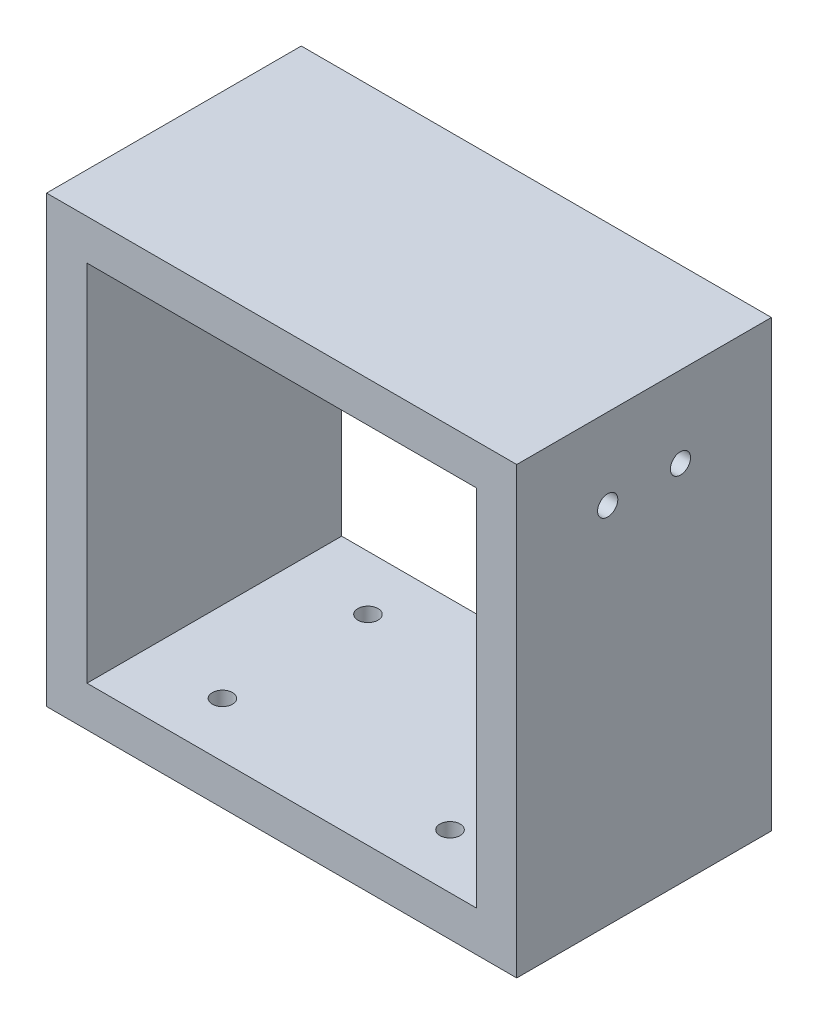
ISO-10303-21;
HEADER;
FILE_DESCRIPTION(('STEP AP214'),'2;1');
FILE_NAME('part.step','',(''),(''),'','','');
FILE_SCHEMA(('AUTOMOTIVE_DESIGN { 1 0 10303 214 1 1 1 1 }'));
ENDSEC;
DATA;
#1=APPLICATION_CONTEXT('core data for automotive mechanical design processes');
#2=APPLICATION_PROTOCOL_DEFINITION('international standard','automotive_design',2000,#1);
#3=PRODUCT_CONTEXT('',#1,'mechanical');
#4=PRODUCT('Part','Part','',(#3));
#5=PRODUCT_RELATED_PRODUCT_CATEGORY('part','',(#4));
#6=PRODUCT_DEFINITION_FORMATION('','',#4);
#7=PRODUCT_DEFINITION_CONTEXT('part definition',#1,'design');
#8=PRODUCT_DEFINITION('design','',#6,#7);
#9=PRODUCT_DEFINITION_SHAPE('','',#8);
#10=(LENGTH_UNIT() NAMED_UNIT(*) SI_UNIT(.MILLI.,.METRE.));
#11=(NAMED_UNIT(*) PLANE_ANGLE_UNIT() SI_UNIT($,.RADIAN.));
#12=(NAMED_UNIT(*) SI_UNIT($,.STERADIAN.) SOLID_ANGLE_UNIT());
#13=UNCERTAINTY_MEASURE_WITH_UNIT(LENGTH_MEASURE(1.E-05),#10,'distance_accuracy_value','');
#14=(GEOMETRIC_REPRESENTATION_CONTEXT(3) GLOBAL_UNCERTAINTY_ASSIGNED_CONTEXT((#13)) GLOBAL_UNIT_ASSIGNED_CONTEXT((#10,
#11,#12)) REPRESENTATION_CONTEXT('',''));
#15=CARTESIAN_POINT('',(0.,0.,0.));
#16=DIRECTION('',(0.,0.,1.));
#17=DIRECTION('',(1.,0.,0.));
#18=AXIS2_PLACEMENT_3D('',#15,#16,#17);
#19=CARTESIAN_POINT('',(0.,-55.,0.));
#20=DIRECTION('',(-1.,0.,0.));
#21=DIRECTION('',(0.,0.,1.));
#22=AXIS2_PLACEMENT_3D('',#19,#20,#21);
#23=PLANE('',#22);
#24=CARTESIAN_POINT('',(0.,-9.99999999999994,-11.25));
#25=DIRECTION('',(-1.,0.,0.));
#26=DIRECTION('',(0.,0.,1.));
#27=AXIS2_PLACEMENT_3D('',#24,#25,#26);
#28=CIRCLE('',#27,1.25);
#29=CARTESIAN_POINT('',(0.,-9.99999999999994,-10.));
#30=VERTEX_POINT('',#29);
#31=EDGE_CURVE('E206',#30,#30,#28,.T.);
#32=ORIENTED_EDGE('',*,*,#31,.F.);
#33=EDGE_LOOP('',(#32));
#34=FACE_BOUND('',#33,.T.);
#35=CARTESIAN_POINT('',(0.,-9.99999999999994,-20.25));
#36=DIRECTION('',(-1.,0.,0.));
#37=DIRECTION('',(0.,0.,1.));
#38=AXIS2_PLACEMENT_3D('',#35,#36,#37);
#39=CIRCLE('',#38,1.25);
#40=CARTESIAN_POINT('',(0.,-9.99999999999994,-19.));
#41=VERTEX_POINT('',#40);
#42=EDGE_CURVE('E211',#41,#41,#39,.T.);
#43=ORIENTED_EDGE('',*,*,#42,.F.);
#44=EDGE_LOOP('',(#43));
#45=FACE_BOUND('',#44,.T.);
#46=DIRECTION('',(0.,0.,1.));
#47=VECTOR('',#46,1.);
#48=CARTESIAN_POINT('',(0.,0.,0.));
#49=LINE('',#48,#47);
#50=CARTESIAN_POINT('',(0.,0.,-31.5));
#51=VERTEX_POINT('',#50);
#52=CARTESIAN_POINT('',(0.,0.,0.));
#53=VERTEX_POINT('',#52);
#54=EDGE_CURVE('E140',#51,#53,#49,.T.);
#55=ORIENTED_EDGE('',*,*,#54,.F.);
#56=DIRECTION('',(0.,1.,0.));
#57=VECTOR('',#56,1.);
#58=CARTESIAN_POINT('',(0.,-55.,-31.5));
#59=LINE('',#58,#57);
#60=CARTESIAN_POINT('',(0.,-55.,-31.5));
#61=VERTEX_POINT('',#60);
#62=EDGE_CURVE('E11',#61,#51,#59,.T.);
#63=ORIENTED_EDGE('',*,*,#62,.F.);
#64=DIRECTION('',(0.,0.,1.));
#65=VECTOR('',#64,1.);
#66=CARTESIAN_POINT('',(0.,-55.,0.));
#67=LINE('',#66,#65);
#68=CARTESIAN_POINT('',(0.,-55.,0.));
#69=VERTEX_POINT('',#68);
#70=EDGE_CURVE('E141',#61,#69,#67,.T.);
#71=ORIENTED_EDGE('',*,*,#70,.T.);
#72=DIRECTION('',(0.,1.,0.));
#73=VECTOR('',#72,1.);
#74=CARTESIAN_POINT('',(0.,-55.,0.));
#75=LINE('',#74,#73);
#76=EDGE_CURVE('E154',#69,#53,#75,.T.);
#77=ORIENTED_EDGE('',*,*,#76,.T.);
#78=EDGE_LOOP('',(#55,#63,#71,#77));
#79=FACE_BOUND('',#78,.T.);
#80=ADVANCED_FACE('F38',(#34,#45,#79),#23,.T.);
#81=CARTESIAN_POINT('',(0.,-55.,-31.5));
#82=DIRECTION('',(0.,0.,-1.));
#83=DIRECTION('',(-1.,0.,0.));
#84=AXIS2_PLACEMENT_3D('',#81,#82,#83);
#85=PLANE('',#84);
#86=DIRECTION('',(-1.,0.,0.));
#87=VECTOR('',#86,1.);
#88=CARTESIAN_POINT('',(4.99999999999999,-5.00000000000001,-31.5));
#89=LINE('',#88,#87);
#90=CARTESIAN_POINT('',(53.15,-5.,-31.5));
#91=VERTEX_POINT('',#90);
#92=CARTESIAN_POINT('',(4.99999999999999,-5.00000000000001,-31.5));
#93=VERTEX_POINT('',#92);
#94=EDGE_CURVE('E117',#91,#93,#89,.T.);
#95=ORIENTED_EDGE('',*,*,#94,.T.);
#96=DIRECTION('',(0.,-1.,0.));
#97=VECTOR('',#96,1.);
#98=CARTESIAN_POINT('',(5.,-50.,-31.5));
#99=LINE('',#98,#97);
#100=CARTESIAN_POINT('',(5.,-50.,-31.5));
#101=VERTEX_POINT('',#100);
#102=EDGE_CURVE('E104',#93,#101,#99,.T.);
#103=ORIENTED_EDGE('',*,*,#102,.T.);
#104=DIRECTION('',(1.,0.,0.));
#105=VECTOR('',#104,1.);
#106=CARTESIAN_POINT('',(5.,-50.,-31.5));
#107=LINE('',#106,#105);
#108=CARTESIAN_POINT('',(53.15,-50.,-31.5));
#109=VERTEX_POINT('',#108);
#110=EDGE_CURVE('E135',#101,#109,#107,.T.);
#111=ORIENTED_EDGE('',*,*,#110,.T.);
#112=DIRECTION('',(0.,1.,0.));
#113=VECTOR('',#112,1.);
#114=CARTESIAN_POINT('',(53.15,-50.,-31.5));
#115=LINE('',#114,#113);
#116=EDGE_CURVE('E125',#109,#91,#115,.T.);
#117=ORIENTED_EDGE('',*,*,#116,.T.);
#118=EDGE_LOOP('',(#95,#103,#111,#117));
#119=FACE_BOUND('',#118,.T.);
#120=DIRECTION('',(-1.,0.,0.));
#121=VECTOR('',#120,1.);
#122=CARTESIAN_POINT('',(0.,0.,-31.5));
#123=LINE('',#122,#121);
#124=CARTESIAN_POINT('',(58.15,0.,-31.5));
#125=VERTEX_POINT('',#124);
#126=EDGE_CURVE('E145',#125,#51,#123,.T.);
#127=ORIENTED_EDGE('',*,*,#126,.F.);
#128=DIRECTION('',(0.,1.,0.));
#129=VECTOR('',#128,1.);
#130=CARTESIAN_POINT('',(58.15,-55.,-31.5));
#131=LINE('',#130,#129);
#132=CARTESIAN_POINT('',(58.15,-55.,-31.5));
#133=VERTEX_POINT('',#132);
#134=EDGE_CURVE('E46',#133,#125,#131,.T.);
#135=ORIENTED_EDGE('',*,*,#134,.F.);
#136=DIRECTION('',(-1.,0.,0.));
#137=VECTOR('',#136,1.);
#138=CARTESIAN_POINT('',(0.,-55.,-31.5));
#139=LINE('',#138,#137);
#140=EDGE_CURVE('E151',#133,#61,#139,.T.);
#141=ORIENTED_EDGE('',*,*,#140,.T.);
#142=ORIENTED_EDGE('',*,*,#62,.T.);
#143=EDGE_LOOP('',(#127,#135,#141,#142));
#144=FACE_BOUND('',#143,.T.);
#145=ADVANCED_FACE('F123',(#119,#144),#85,.T.);
#146=CARTESIAN_POINT('',(58.15,-55.,0.));
#147=DIRECTION('',(1.,0.,0.));
#148=DIRECTION('',(0.,0.,-1.));
#149=AXIS2_PLACEMENT_3D('',#146,#147,#148);
#150=PLANE('',#149);
#151=CARTESIAN_POINT('',(58.15,-9.99999999999996,-20.25));
#152=DIRECTION('',(1.,0.,0.));
#153=DIRECTION('',(0.,0.,-1.));
#154=AXIS2_PLACEMENT_3D('',#151,#152,#153);
#155=CIRCLE('',#154,1.25);
#156=CARTESIAN_POINT('',(58.15,-9.99999999999996,-21.5));
#157=VERTEX_POINT('',#156);
#158=EDGE_CURVE('E196',#157,#157,#155,.T.);
#159=ORIENTED_EDGE('',*,*,#158,.F.);
#160=EDGE_LOOP('',(#159));
#161=FACE_BOUND('',#160,.T.);
#162=CARTESIAN_POINT('',(58.15,-9.99999999999996,-11.25));
#163=DIRECTION('',(1.,0.,0.));
#164=DIRECTION('',(0.,0.,-1.));
#165=AXIS2_PLACEMENT_3D('',#162,#163,#164);
#166=CIRCLE('',#165,1.25);
#167=CARTESIAN_POINT('',(58.15,-9.99999999999996,-12.5));
#168=VERTEX_POINT('',#167);
#169=EDGE_CURVE('E199',#168,#168,#166,.T.);
#170=ORIENTED_EDGE('',*,*,#169,.F.);
#171=EDGE_LOOP('',(#170));
#172=FACE_BOUND('',#171,.T.);
#173=DIRECTION('',(0.,0.,-1.));
#174=VECTOR('',#173,1.);
#175=CARTESIAN_POINT('',(58.15,0.,0.));
#176=LINE('',#175,#174);
#177=CARTESIAN_POINT('',(58.15,0.,0.));
#178=VERTEX_POINT('',#177);
#179=EDGE_CURVE('E160',#178,#125,#176,.T.);
#180=ORIENTED_EDGE('',*,*,#179,.F.);
#181=DIRECTION('',(0.,1.,0.));
#182=VECTOR('',#181,1.);
#183=CARTESIAN_POINT('',(58.15,-55.,0.));
#184=LINE('',#183,#182);
#185=CARTESIAN_POINT('',(58.15,-55.,0.));
#186=VERTEX_POINT('',#185);
#187=EDGE_CURVE('E166',#186,#178,#184,.T.);
#188=ORIENTED_EDGE('',*,*,#187,.F.);
#189=DIRECTION('',(0.,0.,-1.));
#190=VECTOR('',#189,1.);
#191=CARTESIAN_POINT('',(58.15,-55.,0.));
#192=LINE('',#191,#190);
#193=EDGE_CURVE('E148',#186,#133,#192,.T.);
#194=ORIENTED_EDGE('',*,*,#193,.T.);
#195=ORIENTED_EDGE('',*,*,#134,.T.);
#196=EDGE_LOOP('',(#180,#188,#194,#195));
#197=FACE_BOUND('',#196,.T.);
#198=ADVANCED_FACE('F249',(#161,#172,#197),#150,.T.);
#199=CARTESIAN_POINT('',(0.,-55.,0.));
#200=DIRECTION('',(0.,0.,1.));
#201=DIRECTION('',(1.,0.,0.));
#202=AXIS2_PLACEMENT_3D('',#199,#200,#201);
#203=PLANE('',#202);
#204=DIRECTION('',(-1.,0.,0.));
#205=VECTOR('',#204,1.);
#206=CARTESIAN_POINT('',(4.99999999999999,-5.00000000000001,0.));
#207=LINE('',#206,#205);
#208=CARTESIAN_POINT('',(53.15,-5.,0.));
#209=VERTEX_POINT('',#208);
#210=CARTESIAN_POINT('',(4.99999999999999,-5.00000000000001,0.));
#211=VERTEX_POINT('',#210);
#212=EDGE_CURVE('E120',#209,#211,#207,.T.);
#213=ORIENTED_EDGE('',*,*,#212,.F.);
#214=DIRECTION('',(0.,1.,0.));
#215=VECTOR('',#214,1.);
#216=CARTESIAN_POINT('',(53.15,-50.,0.));
#217=LINE('',#216,#215);
#218=CARTESIAN_POINT('',(53.15,-50.,0.));
#219=VERTEX_POINT('',#218);
#220=EDGE_CURVE('E131',#219,#209,#217,.T.);
#221=ORIENTED_EDGE('',*,*,#220,.F.);
#222=DIRECTION('',(1.,0.,0.));
#223=VECTOR('',#222,1.);
#224=CARTESIAN_POINT('',(5.,-50.,0.));
#225=LINE('',#224,#223);
#226=CARTESIAN_POINT('',(5.,-50.,0.));
#227=VERTEX_POINT('',#226);
#228=EDGE_CURVE('E62',#227,#219,#225,.T.);
#229=ORIENTED_EDGE('',*,*,#228,.F.);
#230=DIRECTION('',(0.,-1.,0.));
#231=VECTOR('',#230,1.);
#232=CARTESIAN_POINT('',(5.,-50.,0.));
#233=LINE('',#232,#231);
#234=EDGE_CURVE('E127',#211,#227,#233,.T.);
#235=ORIENTED_EDGE('',*,*,#234,.F.);
#236=EDGE_LOOP('',(#213,#221,#229,#235));
#237=FACE_BOUND('',#236,.T.);
#238=DIRECTION('',(1.,0.,0.));
#239=VECTOR('',#238,1.);
#240=CARTESIAN_POINT('',(0.,0.,0.));
#241=LINE('',#240,#239);
#242=EDGE_CURVE('E157',#53,#178,#241,.T.);
#243=ORIENTED_EDGE('',*,*,#242,.F.);
#244=ORIENTED_EDGE('',*,*,#76,.F.);
#245=DIRECTION('',(1.,0.,0.));
#246=VECTOR('',#245,1.);
#247=CARTESIAN_POINT('',(0.,-55.,0.));
#248=LINE('',#247,#246);
#249=EDGE_CURVE('E144',#69,#186,#248,.T.);
#250=ORIENTED_EDGE('',*,*,#249,.T.);
#251=ORIENTED_EDGE('',*,*,#187,.T.);
#252=EDGE_LOOP('',(#243,#244,#250,#251));
#253=FACE_BOUND('',#252,.T.);
#254=ADVANCED_FACE('F268',(#237,#253),#203,.T.);
#255=CARTESIAN_POINT('',(0.,-55.,0.));
#256=DIRECTION('',(0.,-1.,0.));
#257=DIRECTION('',(0.,0.,-1.));
#258=AXIS2_PLACEMENT_3D('',#255,#256,#257);
#259=PLANE('',#258);
#260=CARTESIAN_POINT('',(15.,-55.,-24.750000000038));
#261=DIRECTION('',(0.,-1.,0.));
#262=DIRECTION('',(0.,0.,-1.));
#263=AXIS2_PLACEMENT_3D('',#260,#261,#262);
#264=CIRCLE('',#263,1.25);
#265=CARTESIAN_POINT('',(15.,-55.,-26.000000000038));
#266=VERTEX_POINT('',#265);
#267=EDGE_CURVE('E187',#266,#266,#264,.T.);
#268=ORIENTED_EDGE('',*,*,#267,.F.);
#269=EDGE_LOOP('',(#268));
#270=FACE_BOUND('',#269,.T.);
#271=CARTESIAN_POINT('',(43.1499999999999,-55.,-6.74999999997087));
#272=DIRECTION('',(0.,-1.,0.));
#273=DIRECTION('',(0.,0.,-1.));
#274=AXIS2_PLACEMENT_3D('',#271,#272,#273);
#275=CIRCLE('',#274,1.25);
#276=CARTESIAN_POINT('',(43.1499999999999,-55.,-7.99999999997087));
#277=VERTEX_POINT('',#276);
#278=EDGE_CURVE('E188',#277,#277,#275,.T.);
#279=ORIENTED_EDGE('',*,*,#278,.F.);
#280=EDGE_LOOP('',(#279));
#281=FACE_BOUND('',#280,.T.);
#282=CARTESIAN_POINT('',(43.1499999999999,-55.,-24.7499999999709));
#283=DIRECTION('',(0.,-1.,0.));
#284=DIRECTION('',(0.,0.,-1.));
#285=AXIS2_PLACEMENT_3D('',#282,#283,#284);
#286=CIRCLE('',#285,1.25);
#287=CARTESIAN_POINT('',(43.1499999999999,-55.,-25.9999999999709));
#288=VERTEX_POINT('',#287);
#289=EDGE_CURVE('E191',#288,#288,#286,.T.);
#290=ORIENTED_EDGE('',*,*,#289,.F.);
#291=EDGE_LOOP('',(#290));
#292=FACE_BOUND('',#291,.T.);
#293=CARTESIAN_POINT('',(15.,-55.,-6.75000000003798));
#294=DIRECTION('',(0.,-1.,0.));
#295=DIRECTION('',(0.,0.,-1.));
#296=AXIS2_PLACEMENT_3D('',#293,#294,#295);
#297=CIRCLE('',#296,1.25);
#298=CARTESIAN_POINT('',(15.,-55.,-8.00000000003798));
#299=VERTEX_POINT('',#298);
#300=EDGE_CURVE('E173',#299,#299,#297,.T.);
#301=ORIENTED_EDGE('',*,*,#300,.F.);
#302=EDGE_LOOP('',(#301));
#303=FACE_BOUND('',#302,.T.);
#304=ORIENTED_EDGE('',*,*,#70,.F.);
#305=ORIENTED_EDGE('',*,*,#140,.F.);
#306=ORIENTED_EDGE('',*,*,#193,.F.);
#307=ORIENTED_EDGE('',*,*,#249,.F.);
#308=EDGE_LOOP('',(#304,#305,#306,#307));
#309=FACE_BOUND('',#308,.T.);
#310=ADVANCED_FACE('F265',(#270,#281,#292,#303,#309),#259,.T.);
#311=CARTESIAN_POINT('',(0.,0.,0.));
#312=DIRECTION('',(0.,-1.,0.));
#313=DIRECTION('',(0.,0.,-1.));
#314=AXIS2_PLACEMENT_3D('',#311,#312,#313);
#315=PLANE('',#314);
#316=ORIENTED_EDGE('',*,*,#54,.T.);
#317=ORIENTED_EDGE('',*,*,#242,.T.);
#318=ORIENTED_EDGE('',*,*,#179,.T.);
#319=ORIENTED_EDGE('',*,*,#126,.T.);
#320=EDGE_LOOP('',(#316,#317,#318,#319));
#321=FACE_BOUND('',#320,.T.);
#322=ADVANCED_FACE('F260',(#321),#315,.F.);
#323=CARTESIAN_POINT('',(4.99999999999999,-5.00000000000001,-97.4046470288704));
#324=DIRECTION('',(0.,1.,0.));
#325=DIRECTION('',(-1.,0.,0.));
#326=AXIS2_PLACEMENT_3D('',#323,#324,#325);
#327=PLANE('',#326);
#328=DIRECTION('',(0.,0.,1.));
#329=VECTOR('',#328,1.);
#330=CARTESIAN_POINT('',(53.15,-5.,-97.4046470288704));
#331=LINE('',#330,#329);
#332=EDGE_CURVE('E54',#91,#209,#331,.T.);
#333=ORIENTED_EDGE('',*,*,#332,.T.);
#334=ORIENTED_EDGE('',*,*,#212,.T.);
#335=DIRECTION('',(0.,0.,1.));
#336=VECTOR('',#335,1.);
#337=CARTESIAN_POINT('',(4.99999999999999,-5.00000000000001,-97.4046470288704));
#338=LINE('',#337,#336);
#339=EDGE_CURVE('E108',#93,#211,#338,.T.);
#340=ORIENTED_EDGE('',*,*,#339,.F.);
#341=ORIENTED_EDGE('',*,*,#94,.F.);
#342=EDGE_LOOP('',(#333,#334,#340,#341));
#343=FACE_BOUND('',#342,.T.);
#344=ADVANCED_FACE('F116',(#343),#327,.F.);
#345=CARTESIAN_POINT('',(5.,-50.,-97.4046470288704));
#346=DIRECTION('',(-1.,0.,0.));
#347=DIRECTION('',(0.,-1.,0.));
#348=AXIS2_PLACEMENT_3D('',#345,#346,#347);
#349=PLANE('',#348);
#350=CARTESIAN_POINT('',(4.99999999999999,-9.99999999999994,-11.25));
#351=DIRECTION('',(1.,0.,0.));
#352=DIRECTION('',(0.,1.,0.));
#353=AXIS2_PLACEMENT_3D('',#350,#351,#352);
#354=CIRCLE('',#353,1.25);
#355=CARTESIAN_POINT('',(4.99999999999999,-8.74999999999994,-11.25));
#356=VERTEX_POINT('',#355);
#357=EDGE_CURVE('E214',#356,#356,#354,.T.);
#358=ORIENTED_EDGE('',*,*,#357,.F.);
#359=EDGE_LOOP('',(#358));
#360=FACE_BOUND('',#359,.T.);
#361=CARTESIAN_POINT('',(4.99999999999999,-9.99999999999994,-20.25));
#362=DIRECTION('',(1.,0.,0.));
#363=DIRECTION('',(0.,1.,0.));
#364=AXIS2_PLACEMENT_3D('',#361,#362,#363);
#365=CIRCLE('',#364,1.25);
#366=CARTESIAN_POINT('',(4.99999999999999,-8.74999999999994,-20.25));
#367=VERTEX_POINT('',#366);
#368=EDGE_CURVE('E215',#367,#367,#365,.T.);
#369=ORIENTED_EDGE('',*,*,#368,.F.);
#370=EDGE_LOOP('',(#369));
#371=FACE_BOUND('',#370,.T.);
#372=ORIENTED_EDGE('',*,*,#339,.T.);
#373=ORIENTED_EDGE('',*,*,#234,.T.);
#374=DIRECTION('',(0.,0.,1.));
#375=VECTOR('',#374,1.);
#376=CARTESIAN_POINT('',(5.,-50.,-97.4046470288704));
#377=LINE('',#376,#375);
#378=EDGE_CURVE('E110',#101,#227,#377,.T.);
#379=ORIENTED_EDGE('',*,*,#378,.F.);
#380=ORIENTED_EDGE('',*,*,#102,.F.);
#381=EDGE_LOOP('',(#372,#373,#379,#380));
#382=FACE_BOUND('',#381,.T.);
#383=ADVANCED_FACE('F106',(#360,#371,#382),#349,.F.);
#384=CARTESIAN_POINT('',(5.,-50.,-97.4046470288704));
#385=DIRECTION('',(0.,-1.,0.));
#386=DIRECTION('',(1.,0.,0.));
#387=AXIS2_PLACEMENT_3D('',#384,#385,#386);
#388=PLANE('',#387);
#389=CARTESIAN_POINT('',(15.,-50.,-24.750000000038));
#390=DIRECTION('',(0.,-1.,0.));
#391=DIRECTION('',(1.,0.,0.));
#392=AXIS2_PLACEMENT_3D('',#389,#390,#391);
#393=CIRCLE('',#392,1.25);
#394=CARTESIAN_POINT('',(16.25,-50.,-24.750000000038));
#395=VERTEX_POINT('',#394);
#396=EDGE_CURVE('E41',#395,#395,#393,.T.);
#397=ORIENTED_EDGE('',*,*,#396,.T.);
#398=EDGE_LOOP('',(#397));
#399=FACE_BOUND('',#398,.T.);
#400=CARTESIAN_POINT('',(43.1499999999999,-50.,-6.74999999997087));
#401=DIRECTION('',(0.,-1.,0.));
#402=DIRECTION('',(1.,0.,0.));
#403=AXIS2_PLACEMENT_3D('',#400,#401,#402);
#404=CIRCLE('',#403,1.25);
#405=CARTESIAN_POINT('',(44.4,-50.,-6.74999999997087));
#406=VERTEX_POINT('',#405);
#407=EDGE_CURVE('E175',#406,#406,#404,.T.);
#408=ORIENTED_EDGE('',*,*,#407,.T.);
#409=EDGE_LOOP('',(#408));
#410=FACE_BOUND('',#409,.T.);
#411=CARTESIAN_POINT('',(43.1499999999999,-50.,-24.7499999999709));
#412=DIRECTION('',(0.,-1.,0.));
#413=DIRECTION('',(1.,0.,0.));
#414=AXIS2_PLACEMENT_3D('',#411,#412,#413);
#415=CIRCLE('',#414,1.25);
#416=CARTESIAN_POINT('',(44.3999999999999,-50.,-24.7499999999709));
#417=VERTEX_POINT('',#416);
#418=EDGE_CURVE('E172',#417,#417,#415,.T.);
#419=ORIENTED_EDGE('',*,*,#418,.T.);
#420=EDGE_LOOP('',(#419));
#421=FACE_BOUND('',#420,.T.);
#422=CARTESIAN_POINT('',(15.,-50.,-6.75000000003798));
#423=DIRECTION('',(0.,-1.,0.));
#424=DIRECTION('',(1.,0.,0.));
#425=AXIS2_PLACEMENT_3D('',#422,#423,#424);
#426=CIRCLE('',#425,1.25);
#427=CARTESIAN_POINT('',(16.25,-50.,-6.75000000003798));
#428=VERTEX_POINT('',#427);
#429=EDGE_CURVE('E169',#428,#428,#426,.T.);
#430=ORIENTED_EDGE('',*,*,#429,.T.);
#431=EDGE_LOOP('',(#430));
#432=FACE_BOUND('',#431,.T.);
#433=ORIENTED_EDGE('',*,*,#378,.T.);
#434=ORIENTED_EDGE('',*,*,#228,.T.);
#435=DIRECTION('',(0.,0.,1.));
#436=VECTOR('',#435,1.);
#437=CARTESIAN_POINT('',(53.15,-50.,-97.4046470288704));
#438=LINE('',#437,#436);
#439=EDGE_CURVE('E134',#109,#219,#438,.T.);
#440=ORIENTED_EDGE('',*,*,#439,.F.);
#441=ORIENTED_EDGE('',*,*,#110,.F.);
#442=EDGE_LOOP('',(#433,#434,#440,#441));
#443=FACE_BOUND('',#442,.T.);
#444=ADVANCED_FACE('F225',(#399,#410,#421,#432,#443),#388,.F.);
#445=CARTESIAN_POINT('',(53.15,-50.,-97.4046470288704));
#446=DIRECTION('',(1.,0.,0.));
#447=DIRECTION('',(0.,0.,-1.));
#448=AXIS2_PLACEMENT_3D('',#445,#446,#447);
#449=PLANE('',#448);
#450=CARTESIAN_POINT('',(53.15,-9.99999999999996,-20.25));
#451=DIRECTION('',(-1.,0.,0.));
#452=DIRECTION('',(0.,0.,1.));
#453=AXIS2_PLACEMENT_3D('',#450,#451,#452);
#454=CIRCLE('',#453,1.25);
#455=CARTESIAN_POINT('',(53.15,-9.99999999999996,-19.));
#456=VERTEX_POINT('',#455);
#457=EDGE_CURVE('E202',#456,#456,#454,.T.);
#458=ORIENTED_EDGE('',*,*,#457,.F.);
#459=EDGE_LOOP('',(#458));
#460=FACE_BOUND('',#459,.T.);
#461=CARTESIAN_POINT('',(53.15,-9.99999999999996,-11.25));
#462=DIRECTION('',(-1.,0.,0.));
#463=DIRECTION('',(0.,0.,1.));
#464=AXIS2_PLACEMENT_3D('',#461,#462,#463);
#465=CIRCLE('',#464,1.25);
#466=CARTESIAN_POINT('',(53.15,-9.99999999999996,-9.99999999999998));
#467=VERTEX_POINT('',#466);
#468=EDGE_CURVE('E203',#467,#467,#465,.T.);
#469=ORIENTED_EDGE('',*,*,#468,.F.);
#470=EDGE_LOOP('',(#469));
#471=FACE_BOUND('',#470,.T.);
#472=ORIENTED_EDGE('',*,*,#439,.T.);
#473=ORIENTED_EDGE('',*,*,#220,.T.);
#474=ORIENTED_EDGE('',*,*,#332,.F.);
#475=ORIENTED_EDGE('',*,*,#116,.F.);
#476=EDGE_LOOP('',(#472,#473,#474,#475));
#477=FACE_BOUND('',#476,.T.);
#478=ADVANCED_FACE('F291',(#460,#471,#477),#449,.F.);
#479=CARTESIAN_POINT('',(15.,-45.,-6.75000000003798));
#480=DIRECTION('',(0.,-1.,0.));
#481=DIRECTION('',(0.,0.,-1.));
#482=AXIS2_PLACEMENT_3D('',#479,#480,#481);
#483=CYLINDRICAL_SURFACE('',#482,1.25);
#484=ORIENTED_EDGE('',*,*,#300,.T.);
#485=EDGE_LOOP('',(#484));
#486=FACE_BOUND('',#485,.T.);
#487=ORIENTED_EDGE('',*,*,#429,.F.);
#488=EDGE_LOOP('',(#487));
#489=FACE_BOUND('',#488,.T.);
#490=ADVANCED_FACE('F293',(#486,#489),#483,.F.);
#491=CARTESIAN_POINT('',(43.1499999999999,-45.,-24.7499999999709));
#492=DIRECTION('',(0.,-1.,0.));
#493=DIRECTION('',(0.,0.,-1.));
#494=AXIS2_PLACEMENT_3D('',#491,#492,#493);
#495=CYLINDRICAL_SURFACE('',#494,1.25);
#496=ORIENTED_EDGE('',*,*,#289,.T.);
#497=EDGE_LOOP('',(#496));
#498=FACE_BOUND('',#497,.T.);
#499=ORIENTED_EDGE('',*,*,#418,.F.);
#500=EDGE_LOOP('',(#499));
#501=FACE_BOUND('',#500,.T.);
#502=ADVANCED_FACE('F297',(#498,#501),#495,.F.);
#503=CARTESIAN_POINT('',(43.1499999999999,-45.,-6.74999999997087));
#504=DIRECTION('',(0.,-1.,0.));
#505=DIRECTION('',(0.,0.,-1.));
#506=AXIS2_PLACEMENT_3D('',#503,#504,#505);
#507=CYLINDRICAL_SURFACE('',#506,1.25);
#508=ORIENTED_EDGE('',*,*,#278,.T.);
#509=EDGE_LOOP('',(#508));
#510=FACE_BOUND('',#509,.T.);
#511=ORIENTED_EDGE('',*,*,#407,.F.);
#512=EDGE_LOOP('',(#511));
#513=FACE_BOUND('',#512,.T.);
#514=ADVANCED_FACE('F299',(#510,#513),#507,.F.);
#515=CARTESIAN_POINT('',(15.,-45.,-24.750000000038));
#516=DIRECTION('',(0.,-1.,0.));
#517=DIRECTION('',(0.,0.,-1.));
#518=AXIS2_PLACEMENT_3D('',#515,#516,#517);
#519=CYLINDRICAL_SURFACE('',#518,1.25);
#520=ORIENTED_EDGE('',*,*,#267,.T.);
#521=EDGE_LOOP('',(#520));
#522=FACE_BOUND('',#521,.T.);
#523=ORIENTED_EDGE('',*,*,#396,.F.);
#524=EDGE_LOOP('',(#523));
#525=FACE_BOUND('',#524,.T.);
#526=ADVANCED_FACE('F302',(#522,#525),#519,.F.);
#527=CARTESIAN_POINT('',(63.15,-9.99999999999996,-11.25));
#528=DIRECTION('',(-1.,0.,0.));
#529=DIRECTION('',(0.,0.,1.));
#530=AXIS2_PLACEMENT_3D('',#527,#528,#529);
#531=CYLINDRICAL_SURFACE('',#530,1.25);
#532=ORIENTED_EDGE('',*,*,#169,.T.);
#533=EDGE_LOOP('',(#532));
#534=FACE_BOUND('',#533,.T.);
#535=ORIENTED_EDGE('',*,*,#468,.T.);
#536=EDGE_LOOP('',(#535));
#537=FACE_BOUND('',#536,.T.);
#538=ADVANCED_FACE('F240',(#534,#537),#531,.F.);
#539=CARTESIAN_POINT('',(63.15,-9.99999999999996,-20.25));
#540=DIRECTION('',(-1.,0.,0.));
#541=DIRECTION('',(0.,0.,1.));
#542=AXIS2_PLACEMENT_3D('',#539,#540,#541);
#543=CYLINDRICAL_SURFACE('',#542,1.25);
#544=ORIENTED_EDGE('',*,*,#158,.T.);
#545=EDGE_LOOP('',(#544));
#546=FACE_BOUND('',#545,.T.);
#547=ORIENTED_EDGE('',*,*,#457,.T.);
#548=EDGE_LOOP('',(#547));
#549=FACE_BOUND('',#548,.T.);
#550=ADVANCED_FACE('F231',(#546,#549),#543,.F.);
#551=CARTESIAN_POINT('',(-5.00000000000001,-9.99999999999994,-20.25));
#552=DIRECTION('',(1.,0.,0.));
#553=DIRECTION('',(0.,1.,0.));
#554=AXIS2_PLACEMENT_3D('',#551,#552,#553);
#555=CYLINDRICAL_SURFACE('',#554,1.25);
#556=ORIENTED_EDGE('',*,*,#42,.T.);
#557=EDGE_LOOP('',(#556));
#558=FACE_BOUND('',#557,.T.);
#559=ORIENTED_EDGE('',*,*,#368,.T.);
#560=EDGE_LOOP('',(#559));
#561=FACE_BOUND('',#560,.T.);
#562=ADVANCED_FACE('F229',(#558,#561),#555,.F.);
#563=CARTESIAN_POINT('',(-5.00000000000001,-9.99999999999994,-11.25));
#564=DIRECTION('',(1.,0.,0.));
#565=DIRECTION('',(0.,1.,0.));
#566=AXIS2_PLACEMENT_3D('',#563,#564,#565);
#567=CYLINDRICAL_SURFACE('',#566,1.25);
#568=ORIENTED_EDGE('',*,*,#31,.T.);
#569=EDGE_LOOP('',(#568));
#570=FACE_BOUND('',#569,.T.);
#571=ORIENTED_EDGE('',*,*,#357,.T.);
#572=EDGE_LOOP('',(#571));
#573=FACE_BOUND('',#572,.T.);
#574=ADVANCED_FACE('F221',(#570,#573),#567,.F.);
#575=CLOSED_SHELL('',(#80,#145,#198,#254,#310,#322,#344,#383,#444,#478,#490,#502,#514,#526,#538,
#550,#562,#574));
#576=MANIFOLD_SOLID_BREP('B2',#575);
#577=ADVANCED_BREP_SHAPE_REPRESENTATION('',(#18,#576),#14);
#578=SHAPE_DEFINITION_REPRESENTATION(#9,#577);
ENDSEC;
END-ISO-10303-21;
